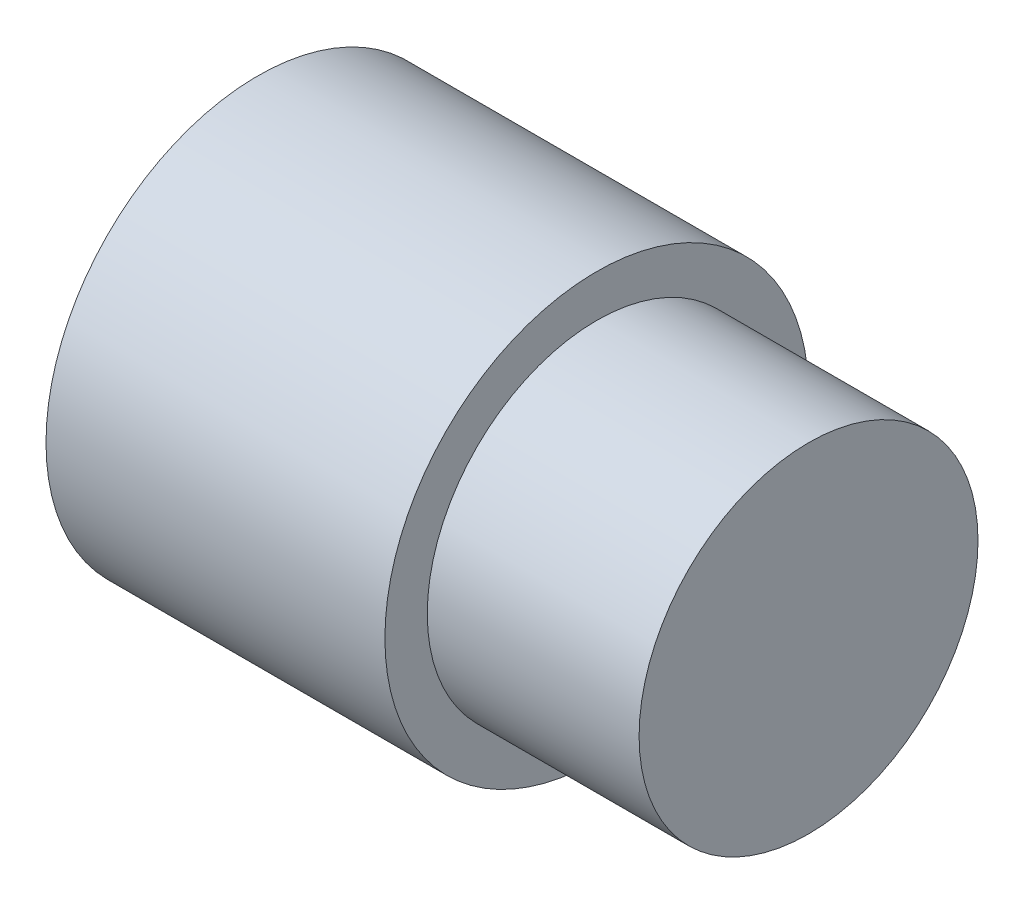
ISO-10303-21;
HEADER;
FILE_DESCRIPTION(('STEP AP214'),'2;1');
FILE_NAME('part.step','',(''),(''),'','','');
FILE_SCHEMA(('AUTOMOTIVE_DESIGN { 1 0 10303 214 1 1 1 1 }'));
ENDSEC;
DATA;
#1=APPLICATION_CONTEXT('core data for automotive mechanical design processes');
#2=APPLICATION_PROTOCOL_DEFINITION('international standard','automotive_design',2000,#1);
#3=PRODUCT_CONTEXT('',#1,'mechanical');
#4=PRODUCT('Part','Part','',(#3));
#5=PRODUCT_RELATED_PRODUCT_CATEGORY('part','',(#4));
#6=PRODUCT_DEFINITION_FORMATION('','',#4);
#7=PRODUCT_DEFINITION_CONTEXT('part definition',#1,'design');
#8=PRODUCT_DEFINITION('design','',#6,#7);
#9=PRODUCT_DEFINITION_SHAPE('','',#8);
#10=(LENGTH_UNIT() NAMED_UNIT(*) SI_UNIT(.MILLI.,.METRE.));
#11=(NAMED_UNIT(*) PLANE_ANGLE_UNIT() SI_UNIT($,.RADIAN.));
#12=(NAMED_UNIT(*) SI_UNIT($,.STERADIAN.) SOLID_ANGLE_UNIT());
#13=UNCERTAINTY_MEASURE_WITH_UNIT(LENGTH_MEASURE(1.E-05),#10,'distance_accuracy_value','');
#14=(GEOMETRIC_REPRESENTATION_CONTEXT(3) GLOBAL_UNCERTAINTY_ASSIGNED_CONTEXT((#13)) GLOBAL_UNIT_ASSIGNED_CONTEXT((#10,
#11,#12)) REPRESENTATION_CONTEXT('',''));
#15=CARTESIAN_POINT('',(0.,0.,0.));
#16=DIRECTION('',(0.,0.,1.));
#17=DIRECTION('',(1.,0.,0.));
#18=AXIS2_PLACEMENT_3D('',#15,#16,#17);
#19=CARTESIAN_POINT('',(25.,0.,0.));
#20=DIRECTION('',(-1.,0.,0.));
#21=DIRECTION('',(0.,0.,1.));
#22=AXIS2_PLACEMENT_3D('',#19,#20,#21);
#23=PLANE('',#22);
#24=CARTESIAN_POINT('',(25.,0.,0.));
#25=DIRECTION('',(-1.,0.,0.));
#26=DIRECTION('',(0.,0.,1.));
#27=AXIS2_PLACEMENT_3D('',#24,#25,#26);
#28=CIRCLE('',#27,20.);
#29=CARTESIAN_POINT('',(25.,0.,20.));
#30=VERTEX_POINT('',#29);
#31=EDGE_CURVE('E10',#30,#30,#28,.T.);
#32=ORIENTED_EDGE('',*,*,#31,.F.);
#33=EDGE_LOOP('',(#32));
#34=FACE_BOUND('',#33,.T.);
#35=ADVANCED_FACE('F34',(#34),#23,.F.);
#36=CARTESIAN_POINT('',(-47.7477477477477,0.,0.));
#37=DIRECTION('',(-1.,0.,0.));
#38=DIRECTION('',(0.,0.,1.));
#39=AXIS2_PLACEMENT_3D('',#36,#37,#38);
#40=CYLINDRICAL_SURFACE('',#39,20.);
#41=CARTESIAN_POINT('',(0.,0.,0.));
#42=DIRECTION('',(-1.,0.,0.));
#43=DIRECTION('',(0.,0.,1.));
#44=AXIS2_PLACEMENT_3D('',#41,#42,#43);
#45=CIRCLE('',#44,20.);
#46=CARTESIAN_POINT('',(0.,0.,20.));
#47=VERTEX_POINT('',#46);
#48=EDGE_CURVE('E41',#47,#47,#45,.T.);
#49=ORIENTED_EDGE('',*,*,#48,.F.);
#50=EDGE_LOOP('',(#49));
#51=FACE_BOUND('',#50,.T.);
#52=ORIENTED_EDGE('',*,*,#31,.T.);
#53=EDGE_LOOP('',(#52));
#54=FACE_BOUND('',#53,.T.);
#55=ADVANCED_FACE('F71',(#51,#54),#40,.T.);
#56=CARTESIAN_POINT('',(0.,0.,-20.));
#57=DIRECTION('',(-1.,0.,0.));
#58=DIRECTION('',(0.,0.,1.));
#59=AXIS2_PLACEMENT_3D('',#56,#57,#58);
#60=PLANE('',#59);
#61=CARTESIAN_POINT('',(0.,0.,0.));
#62=DIRECTION('',(-1.,0.,0.));
#63=DIRECTION('',(0.,0.,1.));
#64=AXIS2_PLACEMENT_3D('',#61,#62,#63);
#65=CIRCLE('',#64,25.);
#66=CARTESIAN_POINT('',(0.,0.,25.));
#67=VERTEX_POINT('',#66);
#68=EDGE_CURVE('E47',#67,#67,#65,.T.);
#69=ORIENTED_EDGE('',*,*,#68,.F.);
#70=EDGE_LOOP('',(#69));
#71=FACE_BOUND('',#70,.T.);
#72=ORIENTED_EDGE('',*,*,#48,.T.);
#73=EDGE_LOOP('',(#72));
#74=FACE_BOUND('',#73,.T.);
#75=ADVANCED_FACE('F66',(#71,#74),#60,.F.);
#76=CARTESIAN_POINT('',(-47.7477477477477,0.,0.));
#77=DIRECTION('',(-1.,0.,0.));
#78=DIRECTION('',(0.,0.,1.));
#79=AXIS2_PLACEMENT_3D('',#76,#77,#78);
#80=CYLINDRICAL_SURFACE('',#79,25.);
#81=CARTESIAN_POINT('',(-40.,0.,0.));
#82=DIRECTION('',(-1.,0.,0.));
#83=DIRECTION('',(0.,0.,1.));
#84=AXIS2_PLACEMENT_3D('',#81,#82,#83);
#85=CIRCLE('',#84,25.);
#86=CARTESIAN_POINT('',(-40.,0.,25.));
#87=VERTEX_POINT('',#86);
#88=EDGE_CURVE('E53',#87,#87,#85,.T.);
#89=ORIENTED_EDGE('',*,*,#88,.F.);
#90=EDGE_LOOP('',(#89));
#91=FACE_BOUND('',#90,.T.);
#92=ORIENTED_EDGE('',*,*,#68,.T.);
#93=EDGE_LOOP('',(#92));
#94=FACE_BOUND('',#93,.T.);
#95=ADVANCED_FACE('F63',(#91,#94),#80,.T.);
#96=CARTESIAN_POINT('',(-40.,0.,-25.));
#97=DIRECTION('',(1.,0.,0.));
#98=DIRECTION('',(0.,0.,-1.));
#99=AXIS2_PLACEMENT_3D('',#96,#97,#98);
#100=PLANE('',#99);
#101=ORIENTED_EDGE('',*,*,#88,.T.);
#102=EDGE_LOOP('',(#101));
#103=FACE_BOUND('',#102,.T.);
#104=ADVANCED_FACE('F61',(#103),#100,.F.);
#105=CLOSED_SHELL('',(#35,#55,#75,#95,#104));
#106=MANIFOLD_SOLID_BREP('B2',#105);
#107=ADVANCED_BREP_SHAPE_REPRESENTATION('',(#18,#106),#14);
#108=SHAPE_DEFINITION_REPRESENTATION(#9,#107);
ENDSEC;
END-ISO-10303-21;
